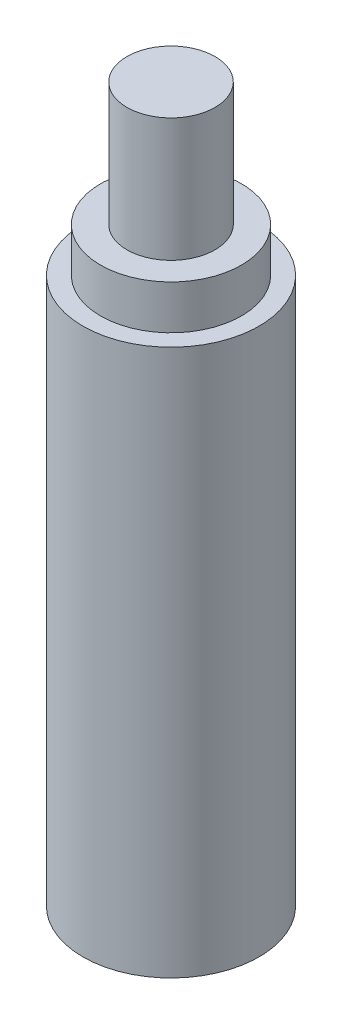
ISO-10303-21;
HEADER;
FILE_DESCRIPTION(('STEP AP214'),'2;1');
FILE_NAME('part.step','',(''),(''),'','','');
FILE_SCHEMA(('AUTOMOTIVE_DESIGN { 1 0 10303 214 1 1 1 1 }'));
ENDSEC;
DATA;
#1=APPLICATION_CONTEXT('core data for automotive mechanical design processes');
#2=APPLICATION_PROTOCOL_DEFINITION('international standard','automotive_design',2000,#1);
#3=PRODUCT_CONTEXT('',#1,'mechanical');
#4=PRODUCT('Part','Part','',(#3));
#5=PRODUCT_RELATED_PRODUCT_CATEGORY('part','',(#4));
#6=PRODUCT_DEFINITION_FORMATION('','',#4);
#7=PRODUCT_DEFINITION_CONTEXT('part definition',#1,'design');
#8=PRODUCT_DEFINITION('design','',#6,#7);
#9=PRODUCT_DEFINITION_SHAPE('','',#8);
#10=(LENGTH_UNIT() NAMED_UNIT(*) SI_UNIT(.MILLI.,.METRE.));
#11=(NAMED_UNIT(*) PLANE_ANGLE_UNIT() SI_UNIT($,.RADIAN.));
#12=(NAMED_UNIT(*) SI_UNIT($,.STERADIAN.) SOLID_ANGLE_UNIT());
#13=UNCERTAINTY_MEASURE_WITH_UNIT(LENGTH_MEASURE(1.E-05),#10,'distance_accuracy_value','');
#14=(GEOMETRIC_REPRESENTATION_CONTEXT(3) GLOBAL_UNCERTAINTY_ASSIGNED_CONTEXT((#13)) GLOBAL_UNIT_ASSIGNED_CONTEXT((#10,
#11,#12)) REPRESENTATION_CONTEXT('',''));
#15=CARTESIAN_POINT('',(0.,0.,0.));
#16=DIRECTION('',(0.,0.,1.));
#17=DIRECTION('',(1.,0.,0.));
#18=AXIS2_PLACEMENT_3D('',#15,#16,#17);
#19=CARTESIAN_POINT('',(0.,67.,0.));
#20=DIRECTION('',(0.,1.,0.));
#21=DIRECTION('',(0.,0.,1.));
#22=AXIS2_PLACEMENT_3D('',#19,#20,#21);
#23=PLANE('',#22);
#24=CARTESIAN_POINT('',(0.,67.,0.));
#25=DIRECTION('',(0.,1.,0.));
#26=DIRECTION('',(0.,0.,1.));
#27=AXIS2_PLACEMENT_3D('',#24,#25,#26);
#28=CIRCLE('',#27,8.);
#29=CARTESIAN_POINT('',(0.,67.,8.));
#30=VERTEX_POINT('',#29);
#31=EDGE_CURVE('E42',#30,#30,#28,.T.);
#32=ORIENTED_EDGE('',*,*,#31,.T.);
#33=EDGE_LOOP('',(#32));
#34=FACE_BOUND('',#33,.T.);
#35=CARTESIAN_POINT('',(0.,67.,0.));
#36=DIRECTION('',(0.,1.,0.));
#37=DIRECTION('',(0.,0.,1.));
#38=AXIS2_PLACEMENT_3D('',#35,#36,#37);
#39=CIRCLE('',#38,5.);
#40=CARTESIAN_POINT('',(0.,67.,5.));
#41=VERTEX_POINT('',#40);
#42=EDGE_CURVE('E50',#41,#41,#39,.T.);
#43=ORIENTED_EDGE('',*,*,#42,.F.);
#44=EDGE_LOOP('',(#43));
#45=FACE_BOUND('',#44,.T.);
#46=ADVANCED_FACE('F31',(#34,#45),#23,.T.);
#47=CARTESIAN_POINT('',(0.,62.,0.));
#48=DIRECTION('',(0.,1.,0.));
#49=DIRECTION('',(0.,0.,1.));
#50=AXIS2_PLACEMENT_3D('',#47,#48,#49);
#51=PLANE('',#50);
#52=CARTESIAN_POINT('',(0.,62.,0.));
#53=DIRECTION('',(0.,1.,0.));
#54=DIRECTION('',(0.,0.,1.));
#55=AXIS2_PLACEMENT_3D('',#52,#53,#54);
#56=CIRCLE('',#55,10.);
#57=CARTESIAN_POINT('',(0.,62.,10.));
#58=VERTEX_POINT('',#57);
#59=EDGE_CURVE('E10',#58,#58,#56,.T.);
#60=ORIENTED_EDGE('',*,*,#59,.T.);
#61=EDGE_LOOP('',(#60));
#62=FACE_BOUND('',#61,.T.);
#63=CARTESIAN_POINT('',(0.,62.,0.));
#64=DIRECTION('',(0.,1.,0.));
#65=DIRECTION('',(0.,0.,1.));
#66=AXIS2_PLACEMENT_3D('',#63,#64,#65);
#67=CIRCLE('',#66,8.);
#68=CARTESIAN_POINT('',(0.,62.,8.));
#69=VERTEX_POINT('',#68);
#70=EDGE_CURVE('E44',#69,#69,#67,.T.);
#71=ORIENTED_EDGE('',*,*,#70,.F.);
#72=EDGE_LOOP('',(#71));
#73=FACE_BOUND('',#72,.T.);
#74=ADVANCED_FACE('F66',(#62,#73),#51,.T.);
#75=CARTESIAN_POINT('',(0.,62.,0.));
#76=DIRECTION('',(0.,-1.,0.));
#77=DIRECTION('',(0.,0.,-1.));
#78=AXIS2_PLACEMENT_3D('',#75,#76,#77);
#79=CYLINDRICAL_SURFACE('',#78,10.);
#80=ORIENTED_EDGE('',*,*,#59,.F.);
#81=EDGE_LOOP('',(#80));
#82=FACE_BOUND('',#81,.T.);
#83=CARTESIAN_POINT('',(0.,0.,0.));
#84=DIRECTION('',(0.,1.,0.));
#85=DIRECTION('',(0.,0.,1.));
#86=AXIS2_PLACEMENT_3D('',#83,#84,#85);
#87=CIRCLE('',#86,10.);
#88=CARTESIAN_POINT('',(0.,0.,10.));
#89=VERTEX_POINT('',#88);
#90=EDGE_CURVE('E35',#89,#89,#87,.T.);
#91=ORIENTED_EDGE('',*,*,#90,.T.);
#92=EDGE_LOOP('',(#91));
#93=FACE_BOUND('',#92,.T.);
#94=ADVANCED_FACE('F33',(#82,#93),#79,.T.);
#95=CARTESIAN_POINT('',(0.,0.,0.));
#96=DIRECTION('',(0.,1.,0.));
#97=DIRECTION('',(0.,0.,1.));
#98=AXIS2_PLACEMENT_3D('',#95,#96,#97);
#99=PLANE('',#98);
#100=ORIENTED_EDGE('',*,*,#90,.F.);
#101=EDGE_LOOP('',(#100));
#102=FACE_BOUND('',#101,.T.);
#103=ADVANCED_FACE('F78',(#102),#99,.F.);
#104=CARTESIAN_POINT('',(0.,67.,0.));
#105=DIRECTION('',(0.,-1.,0.));
#106=DIRECTION('',(0.,0.,-1.));
#107=AXIS2_PLACEMENT_3D('',#104,#105,#106);
#108=CYLINDRICAL_SURFACE('',#107,8.);
#109=ORIENTED_EDGE('',*,*,#31,.F.);
#110=EDGE_LOOP('',(#109));
#111=FACE_BOUND('',#110,.T.);
#112=ORIENTED_EDGE('',*,*,#70,.T.);
#113=EDGE_LOOP('',(#112));
#114=FACE_BOUND('',#113,.T.);
#115=ADVANCED_FACE('F61',(#111,#114),#108,.T.);
#116=CARTESIAN_POINT('',(0.,81.,0.));
#117=DIRECTION('',(0.,-1.,0.));
#118=DIRECTION('',(0.,0.,-1.));
#119=AXIS2_PLACEMENT_3D('',#116,#117,#118);
#120=CYLINDRICAL_SURFACE('',#119,5.);
#121=CARTESIAN_POINT('',(0.,81.,0.));
#122=DIRECTION('',(0.,1.,0.));
#123=DIRECTION('',(0.,0.,1.));
#124=AXIS2_PLACEMENT_3D('',#121,#122,#123);
#125=CIRCLE('',#124,5.);
#126=CARTESIAN_POINT('',(0.,81.,5.));
#127=VERTEX_POINT('',#126);
#128=EDGE_CURVE('E47',#127,#127,#125,.T.);
#129=ORIENTED_EDGE('',*,*,#128,.F.);
#130=EDGE_LOOP('',(#129));
#131=FACE_BOUND('',#130,.T.);
#132=ORIENTED_EDGE('',*,*,#42,.T.);
#133=EDGE_LOOP('',(#132));
#134=FACE_BOUND('',#133,.T.);
#135=ADVANCED_FACE('F58',(#131,#134),#120,.T.);
#136=CARTESIAN_POINT('',(0.,81.,0.));
#137=DIRECTION('',(0.,1.,0.));
#138=DIRECTION('',(0.,0.,1.));
#139=AXIS2_PLACEMENT_3D('',#136,#137,#138);
#140=PLANE('',#139);
#141=ORIENTED_EDGE('',*,*,#128,.T.);
#142=EDGE_LOOP('',(#141));
#143=FACE_BOUND('',#142,.T.);
#144=ADVANCED_FACE('F56',(#143),#140,.T.);
#145=CLOSED_SHELL('',(#46,#74,#94,#103,#115,#135,#144));
#146=MANIFOLD_SOLID_BREP('B2',#145);
#147=ADVANCED_BREP_SHAPE_REPRESENTATION('',(#18,#146),#14);
#148=SHAPE_DEFINITION_REPRESENTATION(#9,#147);
ENDSEC;
END-ISO-10303-21;
